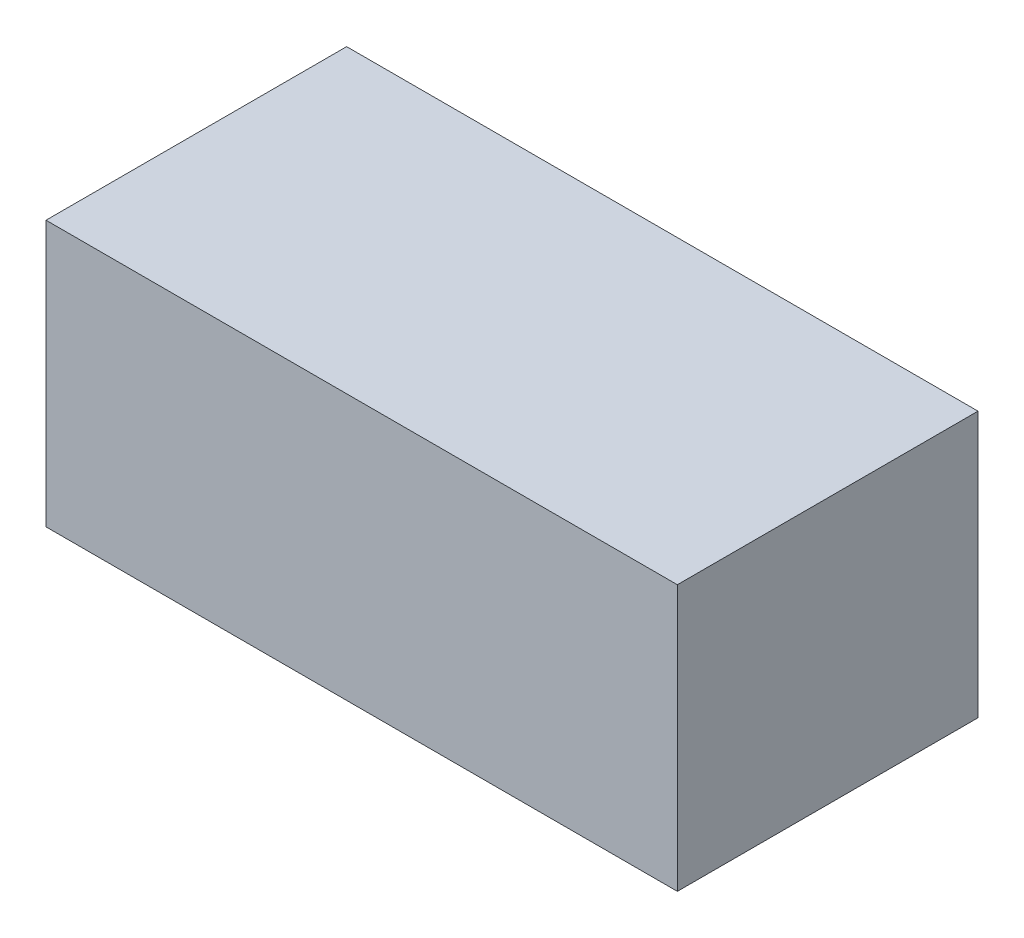
ISO-10303-21;
HEADER;
FILE_DESCRIPTION(('STEP AP214'),'2;1');
FILE_NAME('part.step','',(''),(''),'','','');
FILE_SCHEMA(('AUTOMOTIVE_DESIGN { 1 0 10303 214 1 1 1 1 }'));
ENDSEC;
DATA;
#1=APPLICATION_CONTEXT('core data for automotive mechanical design processes');
#2=APPLICATION_PROTOCOL_DEFINITION('international standard','automotive_design',2000,#1);
#3=PRODUCT_CONTEXT('',#1,'mechanical');
#4=PRODUCT('Part','Part','',(#3));
#5=PRODUCT_RELATED_PRODUCT_CATEGORY('part','',(#4));
#6=PRODUCT_DEFINITION_FORMATION('','',#4);
#7=PRODUCT_DEFINITION_CONTEXT('part definition',#1,'design');
#8=PRODUCT_DEFINITION('design','',#6,#7);
#9=PRODUCT_DEFINITION_SHAPE('','',#8);
#10=(LENGTH_UNIT() NAMED_UNIT(*) SI_UNIT(.MILLI.,.METRE.));
#11=(NAMED_UNIT(*) PLANE_ANGLE_UNIT() SI_UNIT($,.RADIAN.));
#12=(NAMED_UNIT(*) SI_UNIT($,.STERADIAN.) SOLID_ANGLE_UNIT());
#13=UNCERTAINTY_MEASURE_WITH_UNIT(LENGTH_MEASURE(1.E-05),#10,'distance_accuracy_value','');
#14=(GEOMETRIC_REPRESENTATION_CONTEXT(3) GLOBAL_UNCERTAINTY_ASSIGNED_CONTEXT((#13)) GLOBAL_UNIT_ASSIGNED_CONTEXT((#10,
#11,#12)) REPRESENTATION_CONTEXT('',''));
#15=CARTESIAN_POINT('',(0.,0.,0.));
#16=DIRECTION('',(0.,0.,1.));
#17=DIRECTION('',(1.,0.,0.));
#18=AXIS2_PLACEMENT_3D('',#15,#16,#17);
#19=CARTESIAN_POINT('',(31.5,26.5,-15.));
#20=DIRECTION('',(-1.,0.,0.));
#21=DIRECTION('',(0.,0.,1.));
#22=AXIS2_PLACEMENT_3D('',#19,#20,#21);
#23=PLANE('',#22);
#24=DIRECTION('',(0.,0.,-1.));
#25=VECTOR('',#24,1.);
#26=CARTESIAN_POINT('',(31.5,0.,-15.));
#27=LINE('',#26,#25);
#28=CARTESIAN_POINT('',(31.5,0.,15.));
#29=VERTEX_POINT('',#28);
#30=CARTESIAN_POINT('',(31.5,0.,-15.));
#31=VERTEX_POINT('',#30);
#32=EDGE_CURVE('E102',#29,#31,#27,.T.);
#33=ORIENTED_EDGE('',*,*,#32,.T.);
#34=DIRECTION('',(0.,-1.,0.));
#35=VECTOR('',#34,1.);
#36=CARTESIAN_POINT('',(31.5,26.5,-15.));
#37=LINE('',#36,#35);
#38=CARTESIAN_POINT('',(31.5,26.5,-15.));
#39=VERTEX_POINT('',#38);
#40=EDGE_CURVE('E11',#39,#31,#37,.T.);
#41=ORIENTED_EDGE('',*,*,#40,.F.);
#42=DIRECTION('',(0.,0.,-1.));
#43=VECTOR('',#42,1.);
#44=CARTESIAN_POINT('',(31.5,26.5,-15.));
#45=LINE('',#44,#43);
#46=CARTESIAN_POINT('',(31.5,26.5,15.));
#47=VERTEX_POINT('',#46);
#48=EDGE_CURVE('E90',#47,#39,#45,.T.);
#49=ORIENTED_EDGE('',*,*,#48,.F.);
#50=DIRECTION('',(0.,-1.,0.));
#51=VECTOR('',#50,1.);
#52=CARTESIAN_POINT('',(31.5,26.5,15.));
#53=LINE('',#52,#51);
#54=EDGE_CURVE('E98',#47,#29,#53,.T.);
#55=ORIENTED_EDGE('',*,*,#54,.T.);
#56=EDGE_LOOP('',(#33,#41,#49,#55));
#57=FACE_BOUND('',#56,.T.);
#58=ADVANCED_FACE('F39',(#57),#23,.F.);
#59=CARTESIAN_POINT('',(-31.5,26.5,-15.));
#60=DIRECTION('',(0.,0.,1.));
#61=DIRECTION('',(1.,0.,0.));
#62=AXIS2_PLACEMENT_3D('',#59,#60,#61);
#63=PLANE('',#62);
#64=DIRECTION('',(-1.,0.,0.));
#65=VECTOR('',#64,1.);
#66=CARTESIAN_POINT('',(-31.5,0.,-15.));
#67=LINE('',#66,#65);
#68=CARTESIAN_POINT('',(-31.5,0.,-15.));
#69=VERTEX_POINT('',#68);
#70=EDGE_CURVE('E94',#31,#69,#67,.T.);
#71=ORIENTED_EDGE('',*,*,#70,.T.);
#72=DIRECTION('',(0.,-1.,0.));
#73=VECTOR('',#72,1.);
#74=CARTESIAN_POINT('',(-31.5,26.5,-15.));
#75=LINE('',#74,#73);
#76=CARTESIAN_POINT('',(-31.5,26.5,-15.));
#77=VERTEX_POINT('',#76);
#78=EDGE_CURVE('E47',#77,#69,#75,.T.);
#79=ORIENTED_EDGE('',*,*,#78,.F.);
#80=DIRECTION('',(-1.,0.,0.));
#81=VECTOR('',#80,1.);
#82=CARTESIAN_POINT('',(-31.5,26.5,-15.));
#83=LINE('',#82,#81);
#84=EDGE_CURVE('E85',#39,#77,#83,.T.);
#85=ORIENTED_EDGE('',*,*,#84,.F.);
#86=ORIENTED_EDGE('',*,*,#40,.T.);
#87=EDGE_LOOP('',(#71,#79,#85,#86));
#88=FACE_BOUND('',#87,.T.);
#89=ADVANCED_FACE('F93',(#88),#63,.F.);
#90=CARTESIAN_POINT('',(-31.5,26.5,-15.));
#91=DIRECTION('',(1.,0.,0.));
#92=DIRECTION('',(0.,0.,-1.));
#93=AXIS2_PLACEMENT_3D('',#90,#91,#92);
#94=PLANE('',#93);
#95=DIRECTION('',(0.,0.,1.));
#96=VECTOR('',#95,1.);
#97=CARTESIAN_POINT('',(-31.5,0.,-15.));
#98=LINE('',#97,#96);
#99=CARTESIAN_POINT('',(-31.5,0.,15.));
#100=VERTEX_POINT('',#99);
#101=EDGE_CURVE('E72',#69,#100,#98,.T.);
#102=ORIENTED_EDGE('',*,*,#101,.T.);
#103=DIRECTION('',(0.,-1.,0.));
#104=VECTOR('',#103,1.);
#105=CARTESIAN_POINT('',(-31.5,26.5,15.));
#106=LINE('',#105,#104);
#107=CARTESIAN_POINT('',(-31.5,26.5,15.));
#108=VERTEX_POINT('',#107);
#109=EDGE_CURVE('E95',#108,#100,#106,.T.);
#110=ORIENTED_EDGE('',*,*,#109,.F.);
#111=DIRECTION('',(0.,0.,1.));
#112=VECTOR('',#111,1.);
#113=CARTESIAN_POINT('',(-31.5,26.5,-15.));
#114=LINE('',#113,#112);
#115=EDGE_CURVE('E88',#77,#108,#114,.T.);
#116=ORIENTED_EDGE('',*,*,#115,.F.);
#117=ORIENTED_EDGE('',*,*,#78,.T.);
#118=EDGE_LOOP('',(#102,#110,#116,#117));
#119=FACE_BOUND('',#118,.T.);
#120=ADVANCED_FACE('F96',(#119),#94,.F.);
#121=CARTESIAN_POINT('',(-31.5,26.5,15.));
#122=DIRECTION('',(0.,0.,-1.));
#123=DIRECTION('',(-1.,0.,0.));
#124=AXIS2_PLACEMENT_3D('',#121,#122,#123);
#125=PLANE('',#124);
#126=DIRECTION('',(1.,0.,0.));
#127=VECTOR('',#126,1.);
#128=CARTESIAN_POINT('',(-31.5,0.,15.));
#129=LINE('',#128,#127);
#130=EDGE_CURVE('E78',#100,#29,#129,.T.);
#131=ORIENTED_EDGE('',*,*,#130,.T.);
#132=ORIENTED_EDGE('',*,*,#54,.F.);
#133=DIRECTION('',(1.,0.,0.));
#134=VECTOR('',#133,1.);
#135=CARTESIAN_POINT('',(-31.5,26.5,15.));
#136=LINE('',#135,#134);
#137=EDGE_CURVE('E55',#108,#47,#136,.T.);
#138=ORIENTED_EDGE('',*,*,#137,.F.);
#139=ORIENTED_EDGE('',*,*,#109,.T.);
#140=EDGE_LOOP('',(#131,#132,#138,#139));
#141=FACE_BOUND('',#140,.T.);
#142=ADVANCED_FACE('F109',(#141),#125,.F.);
#143=CARTESIAN_POINT('',(0.,26.5,0.));
#144=DIRECTION('',(0.,1.,0.));
#145=DIRECTION('',(0.,0.,1.));
#146=AXIS2_PLACEMENT_3D('',#143,#144,#145);
#147=PLANE('',#146);
#148=ORIENTED_EDGE('',*,*,#48,.T.);
#149=ORIENTED_EDGE('',*,*,#84,.T.);
#150=ORIENTED_EDGE('',*,*,#115,.T.);
#151=ORIENTED_EDGE('',*,*,#137,.T.);
#152=EDGE_LOOP('',(#148,#149,#150,#151));
#153=FACE_BOUND('',#152,.T.);
#154=ADVANCED_FACE('F86',(#153),#147,.T.);
#155=CARTESIAN_POINT('',(0.,0.,0.));
#156=DIRECTION('',(0.,1.,0.));
#157=DIRECTION('',(0.,0.,1.));
#158=AXIS2_PLACEMENT_3D('',#155,#156,#157);
#159=PLANE('',#158);
#160=ORIENTED_EDGE('',*,*,#32,.F.);
#161=ORIENTED_EDGE('',*,*,#130,.F.);
#162=ORIENTED_EDGE('',*,*,#101,.F.);
#163=ORIENTED_EDGE('',*,*,#70,.F.);
#164=EDGE_LOOP('',(#160,#161,#162,#163));
#165=FACE_BOUND('',#164,.T.);
#166=ADVANCED_FACE('F112',(#165),#159,.F.);
#167=CLOSED_SHELL('',(#58,#89,#120,#142,#154,#166));
#168=MANIFOLD_SOLID_BREP('B2',#167);
#169=ADVANCED_BREP_SHAPE_REPRESENTATION('',(#18,#168),#14);
#170=SHAPE_DEFINITION_REPRESENTATION(#9,#169);
ENDSEC;
END-ISO-10303-21;
